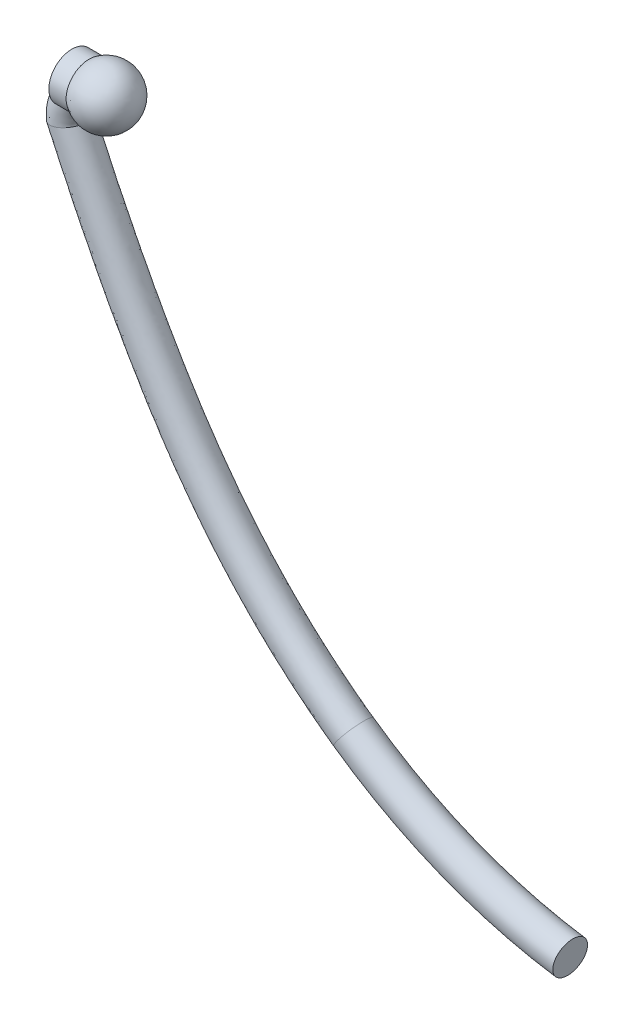
ISO-10303-21;
HEADER;
FILE_DESCRIPTION(('STEP AP214'),'2;1');
FILE_NAME('part.step','',(''),(''),'','','');
FILE_SCHEMA(('AUTOMOTIVE_DESIGN { 1 0 10303 214 1 1 1 1 }'));
ENDSEC;
DATA;
#1=APPLICATION_CONTEXT('core data for automotive mechanical design processes');
#2=APPLICATION_PROTOCOL_DEFINITION('international standard','automotive_design',2000,#1);
#3=PRODUCT_CONTEXT('',#1,'mechanical');
#4=PRODUCT('Part','Part','',(#3));
#5=PRODUCT_RELATED_PRODUCT_CATEGORY('part','',(#4));
#6=PRODUCT_DEFINITION_FORMATION('','',#4);
#7=PRODUCT_DEFINITION_CONTEXT('part definition',#1,'design');
#8=PRODUCT_DEFINITION('design','',#6,#7);
#9=PRODUCT_DEFINITION_SHAPE('','',#8);
#10=(LENGTH_UNIT() NAMED_UNIT(*) SI_UNIT(.MILLI.,.METRE.));
#11=(NAMED_UNIT(*) PLANE_ANGLE_UNIT() SI_UNIT($,.RADIAN.));
#12=(NAMED_UNIT(*) SI_UNIT($,.STERADIAN.) SOLID_ANGLE_UNIT());
#13=UNCERTAINTY_MEASURE_WITH_UNIT(LENGTH_MEASURE(1.E-05),#10,'distance_accuracy_value','');
#14=(GEOMETRIC_REPRESENTATION_CONTEXT(3) GLOBAL_UNCERTAINTY_ASSIGNED_CONTEXT((#13)) GLOBAL_UNIT_ASSIGNED_CONTEXT((#10,
#11,#12)) REPRESENTATION_CONTEXT('',''));
#15=CARTESIAN_POINT('',(0.,0.,0.));
#16=DIRECTION('',(0.,0.,1.));
#17=DIRECTION('',(1.,0.,0.));
#18=AXIS2_PLACEMENT_3D('',#15,#16,#17);
#19=CARTESIAN_POINT('',(4.6683378270188,-0.157972373303339,0.));
#20=DIRECTION('',(0.,0.,1.));
#21=DIRECTION('',(1.,0.,0.));
#22=AXIS2_PLACEMENT_3D('',#19,#20,#21);
#23=TOROIDAL_SURFACE('',#22,4.35916913838642,0.15);
#24=CARTESIAN_POINT('',(2.14830287818379,-3.71490636674639,0.));
#25=DIRECTION('',(-0.815966043189525,0.578099832521711,0.));
#26=DIRECTION('',(-0.578099832521711,-0.815966043189525,0.));
#27=AXIS2_PLACEMENT_3D('',#24,#25,#26);
#28=CIRCLE('',#27,0.15);
#29=CARTESIAN_POINT('',(2.06158790330553,-3.83730127322482,0.));
#30=VERTEX_POINT('',#29);
#31=EDGE_CURVE('E97',#30,#30,#28,.T.);
#32=CARTESIAN_POINT('',(4.03195060482014,-4.47043882308389,0.));
#33=DIRECTION('',(-0.989286332527314,0.14598819224395,0.));
#34=DIRECTION('',(-0.14598819224395,-0.989286332527314,0.));
#35=AXIS2_PLACEMENT_3D('',#32,#33,#34);
#36=CIRCLE('',#35,0.15);
#37=CARTESIAN_POINT('',(4.01005237598355,-4.61883177296299,0.));
#38=VERTEX_POINT('',#37);
#39=EDGE_CURVE('E100',#38,#38,#36,.T.);
#40=CARTESIAN_POINT('',(4.6683378270188,-0.157972373303339,0.));
#41=DIRECTION('',(0.,0.,1.));
#42=DIRECTION('',(1.,0.,0.));
#43=AXIS2_PLACEMENT_3D('',#40,#41,#42);
#44=CIRCLE('',#43,4.50916913838642);
#45=EDGE_CURVE('',#30,#38,#44,.T.);
#46=ORIENTED_EDGE('',*,*,#31,.F.);
#47=ORIENTED_EDGE('',*,*,#39,.T.);
#48=ORIENTED_EDGE('',*,*,#45,.T.);
#49=ORIENTED_EDGE('',*,*,#45,.F.);
#50=EDGE_LOOP('',(#46,#48,#47,#49));
#51=FACE_BOUND('',#50,.T.);
#52=ADVANCED_FACE('F43',(#51),#23,.T.);
#53=CARTESIAN_POINT('',(-0.0106926166099035,0.,-0.15));
#54=CARTESIAN_POINT('',(-0.0274696503355554,0.,-0.15));
#55=CARTESIAN_POINT('',(-0.0599534735682905,-0.00301170350524769,-0.15));
#56=CARTESIAN_POINT('',(-0.113464794008145,-0.017342541017103,-0.15));
#57=CARTESIAN_POINT('',(-0.164321605411706,-0.0410786322695644,-0.15));
#58=CARTESIAN_POINT('',(-0.210670387740324,-0.0740028098065008,-0.15));
#59=CARTESIAN_POINT('',(-0.247819883216438,-0.113463911309629,-0.15));
#60=CARTESIAN_POINT('',(-0.277777842547418,-0.161251769919256,-0.15));
#61=CARTESIAN_POINT('',(-0.298277799674242,-0.212195442170348,-0.15));
#62=CARTESIAN_POINT('',(-0.309642887783869,-0.264944220569104,-0.15));
#63=CARTESIAN_POINT('',(-0.311129569039642,-0.297025149708893,-0.15));
#64=CARTESIAN_POINT('',(-0.31038974592792,-0.313477042648186,-0.15));
#65=CARTESIAN_POINT('',(-0.0106926166099035,0.3,-0.15));
#66=CARTESIAN_POINT('',(-0.0274696503355555,0.3,-0.15));
#67=CARTESIAN_POINT('',(-0.130084532629888,0.292761625748042,-0.15));
#68=CARTESIAN_POINT('',(-0.226669485138322,0.261639016237224,-0.15));
#69=CARTESIAN_POINT('',(-0.333240652841706,0.210519679417798,-0.15));
#70=CARTESIAN_POINT('',(-0.428157989825736,0.13764527150329,-0.15));
#71=CARTESIAN_POINT('',(-0.50724352763309,0.0450309859243433,-0.15));
#72=CARTESIAN_POINT('',(-0.564766868595057,-0.0586436752519592,-0.15));
#73=CARTESIAN_POINT('',(-0.59941218623756,-0.169257346944005,-0.15));
#74=CARTESIAN_POINT('',(-0.617742202380122,-0.26708954029128,-0.15));
#75=CARTESIAN_POINT('',(-0.608203349117243,-0.368839192326159,-0.15));
#76=CARTESIAN_POINT('',(-0.607463526005521,-0.385291085265452,-0.15));
#77=CARTESIAN_POINT('',(-0.0106926166099035,0.3,0.15));
#78=CARTESIAN_POINT('',(-0.0274696503355555,0.3,0.15));
#79=CARTESIAN_POINT('',(-0.130084532629888,0.292761625748042,0.15));
#80=CARTESIAN_POINT('',(-0.226669485138322,0.261639016237224,0.15));
#81=CARTESIAN_POINT('',(-0.333240652841706,0.210519679417798,0.15));
#82=CARTESIAN_POINT('',(-0.428157989825736,0.13764527150329,0.15));
#83=CARTESIAN_POINT('',(-0.50724352763309,0.0450309859243433,0.15));
#84=CARTESIAN_POINT('',(-0.564766868595057,-0.0586436752519592,0.15));
#85=CARTESIAN_POINT('',(-0.59941218623756,-0.169257346944005,0.15));
#86=CARTESIAN_POINT('',(-0.617742202380122,-0.26708954029128,0.15));
#87=CARTESIAN_POINT('',(-0.608203349117243,-0.368839192326159,0.15));
#88=CARTESIAN_POINT('',(-0.607463526005521,-0.385291085265452,0.15));
#89=CARTESIAN_POINT('',(-0.0106926166099035,0.,0.15));
#90=CARTESIAN_POINT('',(-0.0274696503355555,0.,0.15));
#91=CARTESIAN_POINT('',(-0.0599534735682905,-0.00301170350524767,0.15));
#92=CARTESIAN_POINT('',(-0.113464794008145,-0.017342541017103,0.15));
#93=CARTESIAN_POINT('',(-0.164321605411706,-0.0410786322695644,0.15));
#94=CARTESIAN_POINT('',(-0.210670387740324,-0.0740028098065008,0.15));
#95=CARTESIAN_POINT('',(-0.247819883216438,-0.113463911309629,0.15));
#96=CARTESIAN_POINT('',(-0.277777842547418,-0.161251769919256,0.15));
#97=CARTESIAN_POINT('',(-0.298277799674242,-0.212195442170348,0.15));
#98=CARTESIAN_POINT('',(-0.309642887783869,-0.264944220569104,0.15));
#99=CARTESIAN_POINT('',(-0.311129569039642,-0.297025149708893,0.15));
#100=CARTESIAN_POINT('',(-0.31038974592792,-0.313477042648186,0.15));
#101=CARTESIAN_POINT('',(-0.0106926166099035,-0.3,0.15));
#102=CARTESIAN_POINT('',(-0.0274696503355554,-0.3,0.15));
#103=CARTESIAN_POINT('',(0.0101775854933074,-0.298785032758537,0.15));
#104=CARTESIAN_POINT('',(-0.00026010287796747,-0.29632409827143,0.15));
#105=CARTESIAN_POINT('',(0.00459744201829363,-0.292676943956927,0.15));
#106=CARTESIAN_POINT('',(0.0068172143450883,-0.285650891116291,0.15));
#107=CARTESIAN_POINT('',(0.0116037612002133,-0.271958808543602,0.15));
#108=CARTESIAN_POINT('',(0.00921118350022123,-0.263859864586553,0.15));
#109=CARTESIAN_POINT('',(0.00285658688907673,-0.255133537396691,0.15));
#110=CARTESIAN_POINT('',(-0.00154357318761551,-0.262798900846927,0.15));
#111=CARTESIAN_POINT('',(-0.0140557889620412,-0.225211107091628,0.15));
#112=CARTESIAN_POINT('',(-0.013315965850319,-0.241663000030921,0.15));
#113=CARTESIAN_POINT('',(-0.0106926166099035,-0.3,-0.15));
#114=CARTESIAN_POINT('',(-0.0274696503355554,-0.3,-0.15));
#115=CARTESIAN_POINT('',(0.0101775854933074,-0.298785032758537,-0.15));
#116=CARTESIAN_POINT('',(-0.00026010287796747,-0.29632409827143,-0.15));
#117=CARTESIAN_POINT('',(0.00459744201829363,-0.292676943956927,-0.15));
#118=CARTESIAN_POINT('',(0.0068172143450883,-0.285650891116291,-0.15));
#119=CARTESIAN_POINT('',(0.0116037612002133,-0.271958808543602,-0.15));
#120=CARTESIAN_POINT('',(0.00921118350022123,-0.263859864586553,-0.15));
#121=CARTESIAN_POINT('',(0.00285658688907673,-0.255133537396691,-0.15));
#122=CARTESIAN_POINT('',(-0.00154357318761551,-0.262798900846927,-0.15));
#123=CARTESIAN_POINT('',(-0.0140557889620412,-0.225211107091628,-0.15));
#124=CARTESIAN_POINT('',(-0.013315965850319,-0.241663000030921,-0.15));
#125=CARTESIAN_POINT('',(-0.0106926166099035,0.,-0.15));
#126=CARTESIAN_POINT('',(-0.0274696503355554,0.,-0.15));
#127=CARTESIAN_POINT('',(-0.0599534735682905,-0.00301170350524769,-0.15));
#128=CARTESIAN_POINT('',(-0.113464794008145,-0.017342541017103,-0.15));
#129=CARTESIAN_POINT('',(-0.164321605411706,-0.0410786322695644,-0.15));
#130=CARTESIAN_POINT('',(-0.210670387740324,-0.0740028098065008,-0.15));
#131=CARTESIAN_POINT('',(-0.247819883216438,-0.113463911309629,-0.15));
#132=CARTESIAN_POINT('',(-0.277777842547418,-0.161251769919256,-0.15));
#133=CARTESIAN_POINT('',(-0.298277799674242,-0.212195442170348,-0.15));
#134=CARTESIAN_POINT('',(-0.309642887783869,-0.264944220569104,-0.15));
#135=CARTESIAN_POINT('',(-0.311129569039642,-0.297025149708893,-0.15));
#136=CARTESIAN_POINT('',(-0.31038974592792,-0.313477042648186,-0.15));
#137=(BOUNDED_SURFACE() B_SPLINE_SURFACE(3,3,((#53,#54,#55,#56,#57,#58,#59,#60,#61,#62,#63,#64),
(#65,#66,#67,#68,#69,#70,#71,#72,#73,#74,#75,#76),(#77,#78,#79,#80,#81,#82,#83,#84,#85,#86,#87,
#88),(#89,#90,#91,#92,#93,#94,#95,#96,#97,#98,#99,#100),(#101,#102,#103,#104,#105,#106,#107,
#108,#109,#110,#111,#112),(#113,#114,#115,#116,#117,#118,#119,#120,#121,#122,#123,#124),(#125,
#126,#127,#128,#129,#130,#131,#132,#133,#134,#135,#136)),.UNSPECIFIED.,.T.,.F.,
.F.) B_SPLINE_SURFACE_WITH_KNOTS((4,3,4),(4,1,1,1,1,1,1,1,1,4),(0.,0.5,1.),(0.,
0.106998712296848,0.213103105559308,0.322730404856712,0.43873348449175,0.560717281014576,
0.675209813541579,0.78492182544182,0.892114022729404,1.),
.UNSPECIFIED.) GEOMETRIC_REPRESENTATION_ITEM() RATIONAL_B_SPLINE_SURFACE(((1.,1.,1.,1.,1.,1.,1.,
1.,1.,1.,1.,1.),(0.333333333333333,0.333333333333333,0.333333333333333,0.333333333333333,
0.333333333333333,0.333333333333333,0.333333333333333,0.333333333333333,0.333333333333333,
0.333333333333333,0.333333333333333,0.333333333333333),(0.333333333333333,0.333333333333333,
0.333333333333333,0.333333333333333,0.333333333333333,0.333333333333333,0.333333333333333,
0.333333333333333,0.333333333333333,0.333333333333333,0.333333333333333,0.333333333333333),(1.,
1.,1.,1.,1.,1.,1.,1.,1.,1.,1.,1.),(0.333333333333333,0.333333333333333,0.333333333333333,
0.333333333333333,0.333333333333333,0.333333333333333,0.333333333333333,0.333333333333333,
0.333333333333333,0.333333333333333,0.333333333333333,0.333333333333333),(0.333333333333333,
0.333333333333333,0.333333333333333,0.333333333333333,0.333333333333333,0.333333333333333,
0.333333333333333,0.333333333333333,0.333333333333333,0.333333333333333,0.333333333333333,
0.333333333333333),(1.,1.,1.,1.,1.,1.,1.,1.,1.,1.,1.,1.))) REPRESENTATION_ITEM('') SURFACE());
#138=CARTESIAN_POINT('',(-0.3,-0.13632442660121,-0.146340871638279));
#139=CARTESIAN_POINT('',(-0.291818502474103,-0.134771074349212,-0.147770792136745));
#140=CARTESIAN_POINT('',(-0.283450231323316,-0.133605278160628,-0.148825011094066));
#141=CARTESIAN_POINT('',(-0.266503564040278,-0.132260650534532,-0.150031701912849));
#142=CARTESIAN_POINT('',(-0.257923976614928,-0.132090441212485,-0.150176296936062));
#143=CARTESIAN_POINT('',(-0.242702660117426,-0.132887300539601,-0.149468502388049));
#144=CARTESIAN_POINT('',(-0.236041150746102,-0.133617559756583,-0.148823923440012));
#145=CARTESIAN_POINT('',(-0.22299799682498,-0.135870490316118,-0.146770714413771));
#146=CARTESIAN_POINT('',(-0.216615320678774,-0.137389914201777,-0.145365214571096));
#147=CARTESIAN_POINT('',(-0.20428770890698,-0.14115341610631,-0.141712495661896));
#148=CARTESIAN_POINT('',(-0.198344702943137,-0.143400479788089,-0.139461802401719));
#149=CARTESIAN_POINT('',(-0.187095216134687,-0.14842093130494,-0.134107685132454));
#150=CARTESIAN_POINT('',(-0.181789670947321,-0.15119507774512,-0.131003029136151));
#151=CARTESIAN_POINT('',(-0.167346908502363,-0.159692278374496,-0.120721207042659));
#152=CARTESIAN_POINT('',(-0.159195090384491,-0.165773039043938,-0.11243064073482));
#153=CARTESIAN_POINT('',(-0.144698702001729,-0.177878391447108,-0.092278598994195));
#154=CARTESIAN_POINT('',(-0.1387264158046,-0.18379309306052,-0.0800931688613237));
#155=CARTESIAN_POINT('',(-0.12921767409371,-0.193683945670216,-0.0522463959232496));
#156=CARTESIAN_POINT('',(-0.126056341433408,-0.197345056378661,-0.0363438754787482));
#157=CARTESIAN_POINT('',(-0.12315200767178,-0.200691325454606,-0.00324724252667048));
#158=CARTESIAN_POINT('',(-0.123535901790585,-0.200228909166298,0.0139727470184092));
#159=CARTESIAN_POINT('',(-0.128083745440039,-0.195044637379775,0.0473363655607089));
#160=CARTESIAN_POINT('',(-0.132260699483344,-0.190308128499731,0.063476086311276));
#161=CARTESIAN_POINT('',(-0.141610356145592,-0.181058997682091,0.0853360406862491));
#162=CARTESIAN_POINT('',(-0.145238156370045,-0.177620993430543,0.092227999463599));
#163=CARTESIAN_POINT('',(-0.15361980108567,-0.170338802924106,0.105063613440328));
#164=CARTESIAN_POINT('',(-0.15837335116013,-0.166494723015314,0.111007515905291));
#165=CARTESIAN_POINT('',(-0.168767577419578,-0.159041531066968,0.121427965300549));
#166=CARTESIAN_POINT('',(-0.174343067706712,-0.155431399050506,0.125968381193212));
#167=CARTESIAN_POINT('',(-0.18651341412374,-0.148680539107419,0.13386989300969));
#168=CARTESIAN_POINT('',(-0.193106087585328,-0.145538833769761,0.137233464852773));
#169=CARTESIAN_POINT('',(-0.206060351665018,-0.140544904569387,0.142331087111578));
#170=CARTESIAN_POINT('',(-0.212309185952673,-0.138570130119307,0.1442335582865));
#171=CARTESIAN_POINT('',(-0.225190810089566,-0.135408208016379,0.147204033686056));
#172=CARTESIAN_POINT('',(-0.231823740350579,-0.134221350399351,0.148271730652126));
#173=CARTESIAN_POINT('',(-0.251400411195134,-0.13196068761033,0.150308663147927));
#174=CARTESIAN_POINT('',(-0.264571770453159,-0.131981448778525,0.150296188407932));
#175=CARTESIAN_POINT('',(-0.28512758273248,-0.133837029341373,0.148611070080953));
#176=CARTESIAN_POINT('',(-0.292655109216558,-0.134918996050924,0.147626300203813));
#177=CARTESIAN_POINT('',(-0.3,-0.13632442660121,0.146340871638279));
#178=B_SPLINE_CURVE_WITH_KNOTS('',3,(#138,#139,#140,#141,#142,#143,#144,#145,#146,#147,#148,
#149,#150,#151,#152,#153,#154,#155,#156,#157,#158,#159,#160,#161,#162,#163,#164,#165,#166,#167,
#168,#169,#170,#171,#172,#173,#174,#175,#176,#177),.UNSPECIFIED.,.F.,.F.,(4,2,2,2,2,2,2,2,2,2,2,
2,2,2,2,2,2,2,2,4),(0.,0.0254033509689384,0.0510263814614347,0.0711365450637436,
0.0911646022908616,0.111275902996333,0.13141637126025,0.170153531366217,0.213922339772322,
0.262907412259792,0.31365242968593,0.364572086072983,0.390004465663985,0.415430201270287,
0.439421369289156,0.463361755292535,0.483723668410348,0.504093072692354,0.543077794872076,
0.565959582372492),.UNSPECIFIED.);
#179=CARTESIAN_POINT('',(-0.3,-0.136324426621719,-0.146340871640514));
#180=VERTEX_POINT('',#179);
#181=CARTESIAN_POINT('',(-0.150000000008972,-0.173485679987667,-0.0995124054538774));
#182=VERTEX_POINT('',#181);
#183=EDGE_CURVE('E50',#180,#182,#178,.T.);
#184=CARTESIAN_POINT('',(-0.185522112905152,-0.0763793854128624,-0.149156746770508));
#185=CARTESIAN_POINT('',(-0.182659917590673,-0.0851468351349068,-0.148235737071617));
#186=CARTESIAN_POINT('',(-0.179750938898594,-0.093815738062268,-0.146542850337901));
#187=CARTESIAN_POINT('',(-0.173881498074295,-0.110844676461704,-0.141655364743759));
#188=CARTESIAN_POINT('',(-0.170920876917402,-0.119198847343888,-0.138440494082257));
#189=CARTESIAN_POINT('',(-0.165069374094394,-0.13524409980411,-0.130575004603518));
#190=CARTESIAN_POINT('',(-0.162178590505953,-0.142934283926558,-0.125922480326308));
#191=CARTESIAN_POINT('',(-0.156554231268095,-0.157443988348291,-0.115287557773819));
#192=CARTESIAN_POINT('',(-0.153821225842705,-0.164260447493152,-0.109300674835021));
#193=CARTESIAN_POINT('',(-0.148646253930883,-0.17677431412321,-0.0961469219708978));
#194=CARTESIAN_POINT('',(-0.146204160277918,-0.182472211277472,-0.0889805709145032));
#195=CARTESIAN_POINT('',(-0.141887045282364,-0.192322982740882,-0.0739064013851091));
#196=CARTESIAN_POINT('',(-0.139993969771541,-0.196526432871277,-0.0660372142158772));
#197=CARTESIAN_POINT('',(-0.136830711375961,-0.203475028382444,-0.0495782083989309));
#198=CARTESIAN_POINT('',(-0.135559902805097,-0.206221638840069,-0.0409891238266875));
#199=CARTESIAN_POINT('',(-0.133065489098336,-0.211601313478708,-0.0165510729138509));
#200=CARTESIAN_POINT('',(-0.132628511014345,-0.212525377277209,-0.000195004144928447));
#201=CARTESIAN_POINT('',(-0.13417081996489,-0.209221799507476,0.0309831277004947));
#202=CARTESIAN_POINT('',(-0.13602968436768,-0.205250929622711,0.0458409694024201));
#203=CARTESIAN_POINT('',(-0.141539626763105,-0.193112973722117,0.0735806631833264));
#204=CARTESIAN_POINT('',(-0.145218274048006,-0.184881244833589,0.0864279851856373));
#205=CARTESIAN_POINT('',(-0.153818674494955,-0.164390594892553,0.110010908231647));
#206=CARTESIAN_POINT('',(-0.158822041949741,-0.151837949908482,0.120455930349293));
#207=CARTESIAN_POINT('',(-0.169689195298746,-0.122856757457153,0.137662603613675));
#208=CARTESIAN_POINT('',(-0.175589625941333,-0.106174330939669,0.143984009200259));
#209=CARTESIAN_POINT('',(-0.182754436360479,-0.0847992773170973,0.148090772909844));
#210=CARTESIAN_POINT('',(-0.184144744184978,-0.0805974026356759,0.148714882249483));
#211=CARTESIAN_POINT('',(-0.185522112903041,-0.0763793854138791,0.149156746770286));
#212=B_SPLINE_CURVE_WITH_KNOTS('',3,(#184,#185,#186,#187,#188,#189,#190,#191,#192,#193,#194,
#195,#196,#197,#198,#199,#200,#201,#202,#203,#204,#205,#206,#207,#208,#209,#210,#211),
.UNSPECIFIED.,.F.,.F.,(4,2,2,2,2,2,2,2,2,2,2,2,2,4),(0.,0.0277722224573441,0.05592523127772,
0.0841157151953821,0.112402413208885,0.140676700501532,0.167874206371374,0.195044308848945,
0.243092210797593,0.288723503988658,0.335068306608039,0.385546980379702,0.440785984372738,
0.454179177200052),.UNSPECIFIED.);
#213=CARTESIAN_POINT('',(-0.15,-0.173485679995484,0.0995124054402493));
#214=VERTEX_POINT('',#213);
#215=EDGE_CURVE('E73',#182,#214,#212,.T.);
#216=CARTESIAN_POINT('',(-0.3,-0.13632442660121,0.146340871638279));
#217=VERTEX_POINT('',#216);
#218=EDGE_CURVE('E67',#214,#217,#178,.T.);
#219=CARTESIAN_POINT('',(-0.3,-0.2024,-0.149872752138542));
#220=CARTESIAN_POINT('',(-0.3,-0.193183334066761,-0.149744534584434));
#221=CARTESIAN_POINT('',(-0.3,-0.183954063994686,-0.14952496243524));
#222=CARTESIAN_POINT('',(-0.3,-0.156053316296198,-0.148353501123268));
#223=CARTESIAN_POINT('',(-0.3,-0.137398064362987,-0.146881734981553));
#224=CARTESIAN_POINT('',(-0.3,-0.1005187393821,-0.141309176187606));
#225=CARTESIAN_POINT('',(-0.3,-0.0822929812262462,-0.137221517922226));
#226=CARTESIAN_POINT('',(-0.3,-0.0466631547709214,-0.124779037072416));
#227=CARTESIAN_POINT('',(-0.3,-0.0292886891303648,-0.11632564137453));
#228=CARTESIAN_POINT('',(-0.3,-0.00590325467437993,-0.0996370413948092));
#229=CARTESIAN_POINT('',(-0.3,0.00148901231596843,-0.0933461251197612));
#230=CARTESIAN_POINT('',(-0.3,0.0149014045595312,-0.0794552536190237));
#231=CARTESIAN_POINT('',(-0.3,0.0209246093131332,-0.0718583051564581));
#232=CARTESIAN_POINT('',(-0.299999999999999,0.0333020272320747,-0.0520554029936505));
#233=CARTESIAN_POINT('',(-0.3,0.0387473872705408,-0.039248341297767));
#234=CARTESIAN_POINT('',(-0.3,0.0448741645184495,-0.0124768529276353));
#235=CARTESIAN_POINT('',(-0.3,0.0455441154157992,0.00149027799340546));
#236=CARTESIAN_POINT('',(-0.3,0.0420472713314165,0.0280090217415867));
#237=CARTESIAN_POINT('',(-0.3,0.0381381388037452,0.0405963734669742));
#238=CARTESIAN_POINT('',(-0.3,0.0264844661786949,0.0642969203082372));
#239=CARTESIAN_POINT('',(-0.3,0.0186204549088798,0.0753495810860322));
#240=CARTESIAN_POINT('',(-0.3,-0.000901372868759025,0.0960741538360058));
#241=CARTESIAN_POINT('',(-0.3,-0.0129078363120219,0.105406841342617));
#242=CARTESIAN_POINT('',(-0.299999999999999,-0.0469007885574602,0.125732813732562));
#243=CARTESIAN_POINT('',(-0.299999999999998,-0.0704078154437053,0.134065165485169));
#244=CARTESIAN_POINT('',(-0.299999999999991,-0.112305789482778,0.143568017525627));
#245=CARTESIAN_POINT('',(-0.299999999999987,-0.130499600097126,0.14601133252804));
#246=CARTESIAN_POINT('',(-0.300000000000006,-0.157689325472567,0.148279377687109));
#247=CARTESIAN_POINT('',(-0.300000000000017,-0.166628385339337,0.148804282782283));
#248=CARTESIAN_POINT('',(-0.299999999999983,-0.184513028680183,0.149541267325177));
#249=CARTESIAN_POINT('',(-0.29999999999994,-0.193458601365396,0.149753594427999));
#250=CARTESIAN_POINT('',(-0.299999999999839,-0.202399999999837,0.149872752138546));
#251=B_SPLINE_CURVE_WITH_KNOTS('',3,(#219,#220,#221,#222,#223,#224,#225,#226,#227,#228,#229,
#230,#231,#232,#233,#234,#235,#236,#237,#238,#239,#240,#241,#242,#243,#244,#245,#246,#247,#248,
#249,#250),.UNSPECIFIED.,.F.,.F.,(4,2,2,2,2,2,2,2,2,2,2,2,2,2,2,4),(0.,0.0276797338406813,
0.0837253134558729,0.139491672995686,0.196576099254126,0.225537130792788,0.254432359554769,
0.295373909140175,0.336413731128806,0.375250910769142,0.415338909789709,0.460378986253027,
0.533807534906576,0.588802153132808,0.615658316940669,0.64249319117475),.UNSPECIFIED.);
#252=EDGE_CURVE('E62',#180,#217,#251,.T.);
#253=CARTESIAN_POINT('',(-0.31038974592792,-0.313477042648186,-0.15));
#254=CARTESIAN_POINT('',(-0.607463526005521,-0.385291085265452,-0.15));
#255=CARTESIAN_POINT('',(-0.607463526005521,-0.385291085265452,0.15));
#256=CARTESIAN_POINT('',(-0.31038974592792,-0.313477042648186,0.15));
#257=CARTESIAN_POINT('',(-0.013315965850319,-0.241663000030921,0.15));
#258=CARTESIAN_POINT('',(-0.013315965850319,-0.241663000030921,-0.15));
#259=CARTESIAN_POINT('',(-0.31038974592792,-0.313477042648186,-0.15));
#260=(BOUNDED_CURVE() B_SPLINE_CURVE(3,(#253,#254,#255,#256,#257,#258,#259),.UNSPECIFIED.,.T.,
.F.) B_SPLINE_CURVE_WITH_KNOTS((4,3,4),(0.,0.5,1.),
.UNSPECIFIED.) CURVE() GEOMETRIC_REPRESENTATION_ITEM() RATIONAL_B_SPLINE_CURVE((1.,
0.333333333333333,0.333333333333333,1.,0.333333333333333,0.333333333333333,1.)) REPRESENTATION_ITEM(''));
#261=CARTESIAN_POINT('',(-0.31038974592792,-0.313477042648186,-0.15));
#262=VERTEX_POINT('',#261);
#263=EDGE_CURVE('E102',#262,#262,#260,.F.);
#264=ORIENTED_EDGE('',*,*,#183,.T.);
#265=ORIENTED_EDGE('',*,*,#215,.T.);
#266=ORIENTED_EDGE('',*,*,#218,.T.);
#267=ORIENTED_EDGE('',*,*,#252,.F.);
#268=EDGE_LOOP('',(#264,#265,#266,#267));
#269=FACE_BOUND('',#268,.T.);
#270=ORIENTED_EDGE('',*,*,#263,.F.);
#271=EDGE_LOOP('',(#270));
#272=FACE_BOUND('',#271,.T.);
#273=ADVANCED_FACE('F74',(#269,#272),#137,.F.);
#274=CARTESIAN_POINT('',(4.03195060482014,-4.47043882308389,0.15));
#275=DIRECTION('',(-0.989286332527314,0.14598819224395,0.));
#276=DIRECTION('',(-0.14598819224395,-0.989286332527314,0.));
#277=AXIS2_PLACEMENT_3D('',#274,#275,#276);
#278=PLANE('',#277);
#279=ORIENTED_EDGE('',*,*,#39,.F.);
#280=EDGE_LOOP('',(#279));
#281=FACE_BOUND('',#280,.T.);
#282=ADVANCED_FACE('F93',(#281),#278,.F.);
#283=CARTESIAN_POINT('',(-0.31038974592792,-0.313477042648186,-0.15));
#284=CARTESIAN_POINT('',(-0.135227616734426,-0.69597751430129,-0.15));
#285=CARTESIAN_POINT('',(0.223067713454604,-1.43909231449081,-0.15));
#286=CARTESIAN_POINT('',(0.806391530432593,-2.40300671123447,-0.15));
#287=CARTESIAN_POINT('',(1.45451282046506,-3.16302595596204,-0.15));
#288=CARTESIAN_POINT('',(1.90922863917142,-3.54552581630943,-0.15));
#289=CARTESIAN_POINT('',(2.14830287818379,-3.71490636674639,-0.15));
#290=CARTESIAN_POINT('',(-0.013315965850319,-0.241663000030921,-0.15));
#291=CARTESIAN_POINT('',(0.161846163343175,-0.624163471684025,-0.15));
#292=CARTESIAN_POINT('',(0.509264406502667,-1.33471475185417,-0.15));
#293=CARTESIAN_POINT('',(1.06935137734914,-2.2542718302022,-0.15));
#294=CARTESIAN_POINT('',(1.68634678817116,-2.96484464754484,-0.15));
#295=CARTESIAN_POINT('',(2.08265858892793,-3.30073600335258,-0.15));
#296=CARTESIAN_POINT('',(2.3217328279403,-3.47011655378954,-0.15));
#297=CARTESIAN_POINT('',(-0.013315965850319,-0.241663000030921,0.15));
#298=CARTESIAN_POINT('',(0.161846163343175,-0.624163471684025,0.15));
#299=CARTESIAN_POINT('',(0.509264406502667,-1.33471475185417,0.15));
#300=CARTESIAN_POINT('',(1.06935137734914,-2.2542718302022,0.15));
#301=CARTESIAN_POINT('',(1.68634678817116,-2.96484464754484,0.15));
#302=CARTESIAN_POINT('',(2.08265858892793,-3.30073600335258,0.15));
#303=CARTESIAN_POINT('',(2.3217328279403,-3.47011655378954,0.15));
#304=CARTESIAN_POINT('',(-0.31038974592792,-0.313477042648186,0.15));
#305=CARTESIAN_POINT('',(-0.135227616734426,-0.69597751430129,0.15));
#306=CARTESIAN_POINT('',(0.223067713454604,-1.43909231449081,0.15));
#307=CARTESIAN_POINT('',(0.806391530432593,-2.40300671123447,0.15));
#308=CARTESIAN_POINT('',(1.45451282046506,-3.16302595596204,0.15));
#309=CARTESIAN_POINT('',(1.90922863917142,-3.54552581630943,0.15));
#310=CARTESIAN_POINT('',(2.14830287818379,-3.71490636674639,0.15));
#311=CARTESIAN_POINT('',(-0.607463526005521,-0.385291085265452,0.15));
#312=CARTESIAN_POINT('',(-0.432301396812026,-0.767791556918556,0.15));
#313=CARTESIAN_POINT('',(-0.0631289795934594,-1.54346987712746,0.15));
#314=CARTESIAN_POINT('',(0.543431683516046,-2.55174159226673,0.15));
#315=CARTESIAN_POINT('',(1.22267885275896,-3.36120726437924,0.15));
#316=CARTESIAN_POINT('',(1.7357986894149,-3.79031562926629,0.15));
#317=CARTESIAN_POINT('',(1.97487292842728,-3.95969617970325,0.15));
#318=CARTESIAN_POINT('',(-0.607463526005521,-0.385291085265452,-0.15));
#319=CARTESIAN_POINT('',(-0.432301396812026,-0.767791556918555,-0.15));
#320=CARTESIAN_POINT('',(-0.0631289795934594,-1.54346987712746,-0.15));
#321=CARTESIAN_POINT('',(0.543431683516046,-2.55174159226673,-0.15));
#322=CARTESIAN_POINT('',(1.22267885275896,-3.36120726437924,-0.15));
#323=CARTESIAN_POINT('',(1.7357986894149,-3.79031562926629,-0.15));
#324=CARTESIAN_POINT('',(1.97487292842728,-3.95969617970325,-0.15));
#325=CARTESIAN_POINT('',(-0.31038974592792,-0.313477042648186,-0.15));
#326=CARTESIAN_POINT('',(-0.135227616734426,-0.69597751430129,-0.15));
#327=CARTESIAN_POINT('',(0.223067713454604,-1.43909231449081,-0.15));
#328=CARTESIAN_POINT('',(0.806391530432593,-2.40300671123447,-0.15));
#329=CARTESIAN_POINT('',(1.45451282046506,-3.16302595596204,-0.15));
#330=CARTESIAN_POINT('',(1.90922863917142,-3.54552581630943,-0.15));
#331=CARTESIAN_POINT('',(2.14830287818379,-3.71490636674639,-0.15));
#332=(BOUNDED_SURFACE() B_SPLINE_SURFACE(3,3,((#283,#284,#285,#286,#287,#288,#289),(#290,#291,
#292,#293,#294,#295,#296),(#297,#298,#299,#300,#301,#302,#303),(#304,#305,#306,#307,#308,#309,
#310),(#311,#312,#313,#314,#315,#316,#317),(#318,#319,#320,#321,#322,#323,#324),(#325,#326,#327,
#328,#329,#330,#331)),.UNSPECIFIED.,.T.,.F.,.F.) B_SPLINE_SURFACE_WITH_KNOTS((4,3,4),(4,1,1,1,
4),(0.,0.5,1.),(0.,0.297181264336349,0.582557534008149,0.79302918637301,1.),
.UNSPECIFIED.) GEOMETRIC_REPRESENTATION_ITEM() RATIONAL_B_SPLINE_SURFACE(((1.,1.,1.,1.,1.,1.,
1.),(0.333333333333333,0.333333333333333,0.333333333333333,0.333333333333334,0.333333333333333,
0.333333333333333,0.333333333333333),(0.333333333333333,0.333333333333333,0.333333333333333,
0.333333333333334,0.333333333333333,0.333333333333333,0.333333333333333),(1.,1.,1.,1.,1.,1.,1.),
(0.333333333333333,0.333333333333333,0.333333333333333,0.333333333333334,0.333333333333333,
0.333333333333333,0.333333333333333),(0.333333333333333,0.333333333333333,0.333333333333333,
0.333333333333334,0.333333333333333,0.333333333333333,0.333333333333333),(1.,1.,1.,1.,1.,1.,1.))) REPRESENTATION_ITEM('') SURFACE());
#333=ORIENTED_EDGE('',*,*,#263,.T.);
#334=EDGE_LOOP('',(#333));
#335=FACE_BOUND('',#334,.T.);
#336=ORIENTED_EDGE('',*,*,#31,.T.);
#337=EDGE_LOOP('',(#336));
#338=FACE_BOUND('',#337,.T.);
#339=ADVANCED_FACE('F125',(#335,#338),#332,.T.);
#340=CARTESIAN_POINT('',(-0.3,0.,0.));
#341=DIRECTION('',(1.,0.,0.));
#342=DIRECTION('',(0.,0.,-1.));
#343=AXIS2_PLACEMENT_3D('',#340,#341,#342);
#344=CYLINDRICAL_SURFACE('',#343,0.2);
#345=CARTESIAN_POINT('',(-0.15,0.,0.));
#346=DIRECTION('',(1.,0.,0.));
#347=DIRECTION('',(0.,0.,-1.));
#348=AXIS2_PLACEMENT_3D('',#345,#346,#347);
#349=CIRCLE('',#348,0.2);
#350=EDGE_CURVE('E12',#182,#214,#349,.T.);
#351=ORIENTED_EDGE('',*,*,#350,.F.);
#352=ORIENTED_EDGE('',*,*,#183,.F.);
#353=CARTESIAN_POINT('',(-0.3,0.,0.));
#354=DIRECTION('',(1.,0.,0.));
#355=DIRECTION('',(0.,0.,-1.));
#356=AXIS2_PLACEMENT_3D('',#353,#354,#355);
#357=CIRCLE('',#356,0.2);
#358=EDGE_CURVE('E71',#180,#217,#357,.T.);
#359=ORIENTED_EDGE('',*,*,#358,.T.);
#360=ORIENTED_EDGE('',*,*,#218,.F.);
#361=EDGE_LOOP('',(#351,#352,#359,#360));
#362=FACE_BOUND('',#361,.T.);
#363=ADVANCED_FACE('F69',(#362),#344,.T.);
#364=CARTESIAN_POINT('',(-0.3,0.,0.));
#365=DIRECTION('',(1.,0.,0.));
#366=DIRECTION('',(0.,0.,-1.));
#367=AXIS2_PLACEMENT_3D('',#364,#365,#366);
#368=PLANE('',#367);
#369=ORIENTED_EDGE('',*,*,#358,.F.);
#370=ORIENTED_EDGE('',*,*,#252,.T.);
#371=EDGE_LOOP('',(#369,#370));
#372=FACE_BOUND('',#371,.T.);
#373=ADVANCED_FACE('F80',(#372),#368,.F.);
#374=CARTESIAN_POINT('',(0.,0.,0.));
#375=DIRECTION('',(0.,1.,0.));
#376=DIRECTION('',(0.,0.,-1.));
#377=AXIS2_PLACEMENT_3D('',#374,#375,#376);
#378=SPHERICAL_SURFACE('',#377,0.25);
#379=ORIENTED_EDGE('',*,*,#215,.F.);
#380=ORIENTED_EDGE('',*,*,#350,.T.);
#381=EDGE_LOOP('',(#379,#380));
#382=FACE_BOUND('',#381,.T.);
#383=ADVANCED_FACE('F78',(#382),#378,.T.);
#384=CLOSED_SHELL('',(#52,#273,#282,#339,#363,#373,#383));
#385=MANIFOLD_SOLID_BREP('B2',#384);
#386=ADVANCED_BREP_SHAPE_REPRESENTATION('',(#18,#385),#14);
#387=SHAPE_DEFINITION_REPRESENTATION(#9,#386);
ENDSEC;
END-ISO-10303-21;
